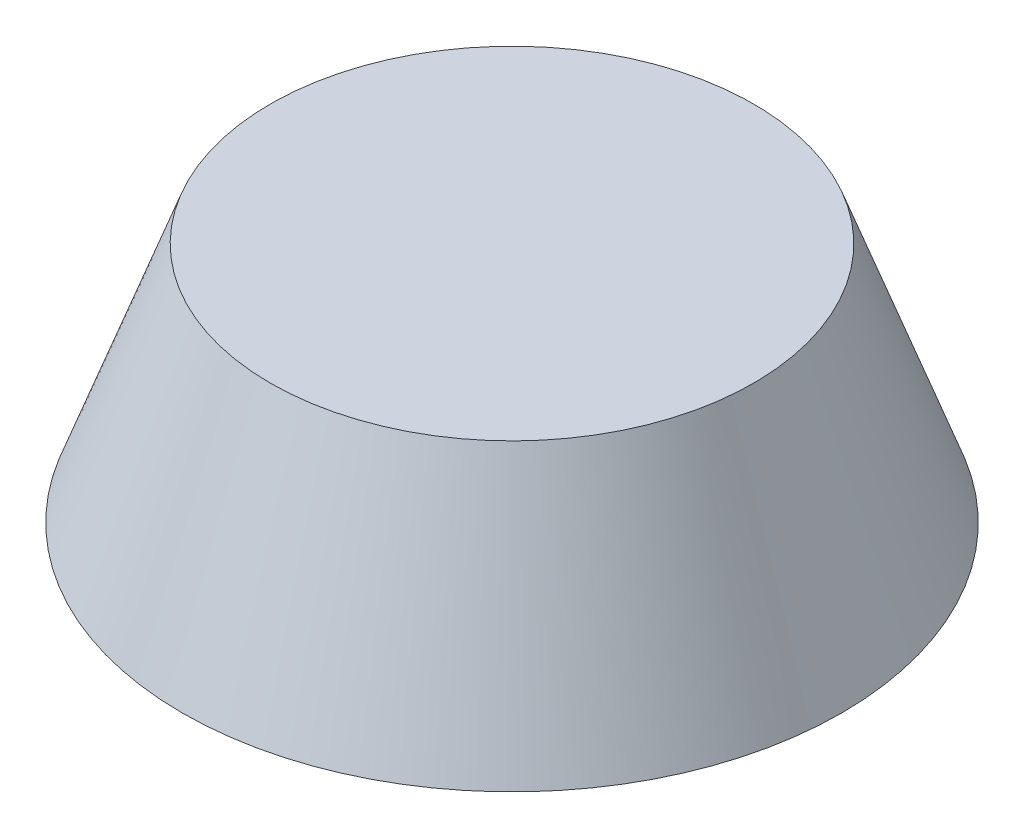
ISO-10303-21;
HEADER;
FILE_DESCRIPTION(('STEP AP214'),'2;1');
FILE_NAME('part.step','',(''),(''),'','','');
FILE_SCHEMA(('AUTOMOTIVE_DESIGN { 1 0 10303 214 1 1 1 1 }'));
ENDSEC;
DATA;
#1=APPLICATION_CONTEXT('core data for automotive mechanical design processes');
#2=APPLICATION_PROTOCOL_DEFINITION('international standard','automotive_design',2000,#1);
#3=PRODUCT_CONTEXT('',#1,'mechanical');
#4=PRODUCT('Part','Part','',(#3));
#5=PRODUCT_RELATED_PRODUCT_CATEGORY('part','',(#4));
#6=PRODUCT_DEFINITION_FORMATION('','',#4);
#7=PRODUCT_DEFINITION_CONTEXT('part definition',#1,'design');
#8=PRODUCT_DEFINITION('design','',#6,#7);
#9=PRODUCT_DEFINITION_SHAPE('','',#8);
#10=(LENGTH_UNIT() NAMED_UNIT(*) SI_UNIT(.MILLI.,.METRE.));
#11=(NAMED_UNIT(*) PLANE_ANGLE_UNIT() SI_UNIT($,.RADIAN.));
#12=(NAMED_UNIT(*) SI_UNIT($,.STERADIAN.) SOLID_ANGLE_UNIT());
#13=UNCERTAINTY_MEASURE_WITH_UNIT(LENGTH_MEASURE(1.E-05),#10,'distance_accuracy_value','');
#14=(GEOMETRIC_REPRESENTATION_CONTEXT(3) GLOBAL_UNCERTAINTY_ASSIGNED_CONTEXT((#13)) GLOBAL_UNIT_ASSIGNED_CONTEXT((#10,
#11,#12)) REPRESENTATION_CONTEXT('',''));
#15=CARTESIAN_POINT('',(0.,0.,0.));
#16=DIRECTION('',(0.,0.,1.));
#17=DIRECTION('',(1.,0.,0.));
#18=AXIS2_PLACEMENT_3D('',#15,#16,#17);
#19=CARTESIAN_POINT('',(0.,3.,0.));
#20=DIRECTION('',(0.,-1.,0.));
#21=DIRECTION('',(0.,0.,1.));
#22=AXIS2_PLACEMENT_3D('',#19,#20,#21);
#23=CONICAL_SURFACE('',#22,3.,0.349065850398867);
#24=CARTESIAN_POINT('',(0.,3.,0.));
#25=DIRECTION('',(0.,1.,0.));
#26=DIRECTION('',(0.,0.,1.));
#27=AXIS2_PLACEMENT_3D('',#24,#25,#26);
#28=CIRCLE('',#27,3.);
#29=CARTESIAN_POINT('',(0.,3.,3.));
#30=VERTEX_POINT('',#29);
#31=EDGE_CURVE('E10',#30,#30,#28,.T.);
#32=ORIENTED_EDGE('',*,*,#31,.F.);
#33=EDGE_LOOP('',(#32));
#34=FACE_BOUND('',#33,.T.);
#35=CARTESIAN_POINT('',(0.,0.,0.));
#36=DIRECTION('',(0.,1.,0.));
#37=DIRECTION('',(0.,0.,1.));
#38=AXIS2_PLACEMENT_3D('',#35,#36,#37);
#39=CIRCLE('',#38,4.09191070279861);
#40=CARTESIAN_POINT('',(0.,0.,4.09191070279861));
#41=VERTEX_POINT('',#40);
#42=EDGE_CURVE('E52',#41,#41,#39,.T.);
#43=ORIENTED_EDGE('',*,*,#42,.T.);
#44=EDGE_LOOP('',(#43));
#45=FACE_BOUND('',#44,.T.);
#46=ADVANCED_FACE('F49',(#34,#45),#23,.T.);
#47=CARTESIAN_POINT('',(0.,3.,0.));
#48=DIRECTION('',(0.,1.,0.));
#49=DIRECTION('',(0.,0.,1.));
#50=AXIS2_PLACEMENT_3D('',#47,#48,#49);
#51=PLANE('',#50);
#52=ORIENTED_EDGE('',*,*,#31,.T.);
#53=EDGE_LOOP('',(#52));
#54=FACE_BOUND('',#53,.T.);
#55=ADVANCED_FACE('F64',(#54),#51,.T.);
#56=CARTESIAN_POINT('',(0.,0.,0.));
#57=DIRECTION('',(0.,1.,0.));
#58=DIRECTION('',(0.,0.,1.));
#59=AXIS2_PLACEMENT_3D('',#56,#57,#58);
#60=PLANE('',#59);
#61=ORIENTED_EDGE('',*,*,#42,.F.);
#62=EDGE_LOOP('',(#61));
#63=FACE_BOUND('',#62,.T.);
#64=ADVANCED_FACE('F62',(#63),#60,.F.);
#65=CLOSED_SHELL('',(#46,#55,#64));
#66=MANIFOLD_SOLID_BREP('B2',#65);
#67=ADVANCED_BREP_SHAPE_REPRESENTATION('',(#18,#66),#14);
#68=SHAPE_DEFINITION_REPRESENTATION(#9,#67);
ENDSEC;
END-ISO-10303-21;
